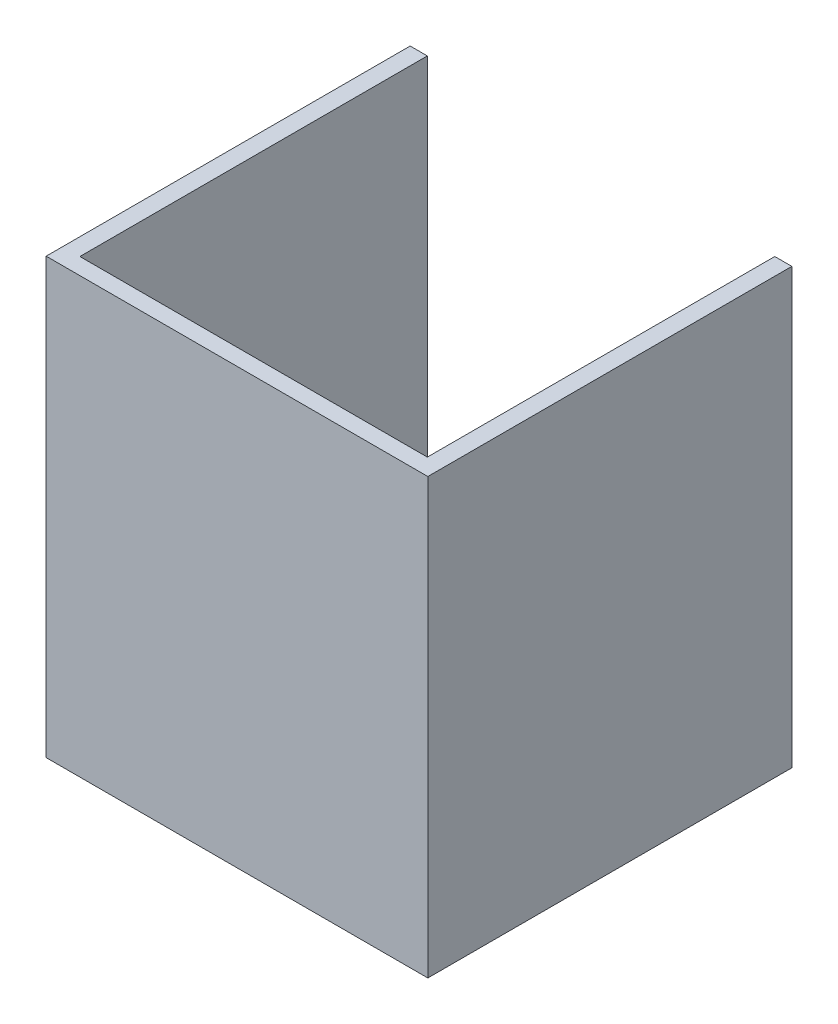
ISO-10303-21;
HEADER;
FILE_DESCRIPTION(('STEP AP214'),'2;1');
FILE_NAME('part.step','',(''),(''),'','','');
FILE_SCHEMA(('AUTOMOTIVE_DESIGN { 1 0 10303 214 1 1 1 1 }'));
ENDSEC;
DATA;
#1=APPLICATION_CONTEXT('core data for automotive mechanical design processes');
#2=APPLICATION_PROTOCOL_DEFINITION('international standard','automotive_design',2000,#1);
#3=PRODUCT_CONTEXT('',#1,'mechanical');
#4=PRODUCT('Part','Part','',(#3));
#5=PRODUCT_RELATED_PRODUCT_CATEGORY('part','',(#4));
#6=PRODUCT_DEFINITION_FORMATION('','',#4);
#7=PRODUCT_DEFINITION_CONTEXT('part definition',#1,'design');
#8=PRODUCT_DEFINITION('design','',#6,#7);
#9=PRODUCT_DEFINITION_SHAPE('','',#8);
#10=(LENGTH_UNIT() NAMED_UNIT(*) SI_UNIT(.MILLI.,.METRE.));
#11=(NAMED_UNIT(*) PLANE_ANGLE_UNIT() SI_UNIT($,.RADIAN.));
#12=(NAMED_UNIT(*) SI_UNIT($,.STERADIAN.) SOLID_ANGLE_UNIT());
#13=UNCERTAINTY_MEASURE_WITH_UNIT(LENGTH_MEASURE(1.E-05),#10,'distance_accuracy_value','');
#14=(GEOMETRIC_REPRESENTATION_CONTEXT(3) GLOBAL_UNCERTAINTY_ASSIGNED_CONTEXT((#13)) GLOBAL_UNIT_ASSIGNED_CONTEXT((#10,
#11,#12)) REPRESENTATION_CONTEXT('',''));
#15=CARTESIAN_POINT('',(0.,0.,0.));
#16=DIRECTION('',(0.,0.,1.));
#17=DIRECTION('',(1.,0.,0.));
#18=AXIS2_PLACEMENT_3D('',#15,#16,#17);
#19=CARTESIAN_POINT('',(0.,63.5,0.));
#20=DIRECTION('',(1.,0.,0.));
#21=DIRECTION('',(0.,0.,-1.));
#22=AXIS2_PLACEMENT_3D('',#19,#20,#21);
#23=PLANE('',#22);
#24=DIRECTION('',(0.,0.,1.));
#25=VECTOR('',#24,1.);
#26=CARTESIAN_POINT('',(0.,0.,0.));
#27=LINE('',#26,#25);
#28=CARTESIAN_POINT('',(0.,0.,0.));
#29=VERTEX_POINT('',#28);
#30=CARTESIAN_POINT('',(0.,0.,50.8));
#31=VERTEX_POINT('',#30);
#32=EDGE_CURVE('E130',#29,#31,#27,.T.);
#33=ORIENTED_EDGE('',*,*,#32,.T.);
#34=DIRECTION('',(0.,-1.,0.));
#35=VECTOR('',#34,1.);
#36=CARTESIAN_POINT('',(0.,63.5,50.8));
#37=LINE('',#36,#35);
#38=CARTESIAN_POINT('',(0.,63.5,50.8));
#39=VERTEX_POINT('',#38);
#40=EDGE_CURVE('E11',#39,#31,#37,.T.);
#41=ORIENTED_EDGE('',*,*,#40,.F.);
#42=DIRECTION('',(0.,0.,1.));
#43=VECTOR('',#42,1.);
#44=CARTESIAN_POINT('',(0.,63.5,0.));
#45=LINE('',#44,#43);
#46=CARTESIAN_POINT('',(0.,63.5,0.));
#47=VERTEX_POINT('',#46);
#48=EDGE_CURVE('E149',#47,#39,#45,.T.);
#49=ORIENTED_EDGE('',*,*,#48,.F.);
#50=DIRECTION('',(0.,-1.,0.));
#51=VECTOR('',#50,1.);
#52=CARTESIAN_POINT('',(0.,63.5,0.));
#53=LINE('',#52,#51);
#54=EDGE_CURVE('E49',#47,#29,#53,.T.);
#55=ORIENTED_EDGE('',*,*,#54,.T.);
#56=EDGE_LOOP('',(#33,#41,#49,#55));
#57=FACE_BOUND('',#56,.T.);
#58=ADVANCED_FACE('F33',(#57),#23,.F.);
#59=CARTESIAN_POINT('',(0.,63.5,50.8));
#60=DIRECTION('',(0.,0.,1.));
#61=DIRECTION('',(1.,0.,0.));
#62=AXIS2_PLACEMENT_3D('',#59,#60,#61);
#63=PLANE('',#62);
#64=DIRECTION('',(-1.,0.,0.));
#65=VECTOR('',#64,1.);
#66=CARTESIAN_POINT('',(0.,0.,50.8));
#67=LINE('',#66,#65);
#68=CARTESIAN_POINT('',(-50.8,0.,50.8));
#69=VERTEX_POINT('',#68);
#70=EDGE_CURVE('E132',#31,#69,#67,.T.);
#71=ORIENTED_EDGE('',*,*,#70,.T.);
#72=DIRECTION('',(0.,-1.,0.));
#73=VECTOR('',#72,1.);
#74=CARTESIAN_POINT('',(-50.8,63.5,50.8));
#75=LINE('',#74,#73);
#76=CARTESIAN_POINT('',(-50.8,63.5,50.8));
#77=VERTEX_POINT('',#76);
#78=EDGE_CURVE('E41',#77,#69,#75,.T.);
#79=ORIENTED_EDGE('',*,*,#78,.F.);
#80=DIRECTION('',(-1.,0.,0.));
#81=VECTOR('',#80,1.);
#82=CARTESIAN_POINT('',(0.,63.5,50.8));
#83=LINE('',#82,#81);
#84=EDGE_CURVE('E87',#39,#77,#83,.T.);
#85=ORIENTED_EDGE('',*,*,#84,.F.);
#86=ORIENTED_EDGE('',*,*,#40,.T.);
#87=EDGE_LOOP('',(#71,#79,#85,#86));
#88=FACE_BOUND('',#87,.T.);
#89=ADVANCED_FACE('F176',(#88),#63,.F.);
#90=CARTESIAN_POINT('',(-50.8,63.5,50.8));
#91=DIRECTION('',(-1.,0.,0.));
#92=DIRECTION('',(0.,0.,1.));
#93=AXIS2_PLACEMENT_3D('',#90,#91,#92);
#94=PLANE('',#93);
#95=DIRECTION('',(0.,0.,-1.));
#96=VECTOR('',#95,1.);
#97=CARTESIAN_POINT('',(-50.8,0.,50.8));
#98=LINE('',#97,#96);
#99=CARTESIAN_POINT('',(-50.8,0.,0.));
#100=VERTEX_POINT('',#99);
#101=EDGE_CURVE('E134',#69,#100,#98,.T.);
#102=ORIENTED_EDGE('',*,*,#101,.T.);
#103=DIRECTION('',(0.,-1.,0.));
#104=VECTOR('',#103,1.);
#105=CARTESIAN_POINT('',(-50.8,63.5,0.));
#106=LINE('',#105,#104);
#107=CARTESIAN_POINT('',(-50.8,63.5,0.));
#108=VERTEX_POINT('',#107);
#109=EDGE_CURVE('E155',#108,#100,#106,.T.);
#110=ORIENTED_EDGE('',*,*,#109,.F.);
#111=DIRECTION('',(0.,0.,-1.));
#112=VECTOR('',#111,1.);
#113=CARTESIAN_POINT('',(-50.8,63.5,50.8));
#114=LINE('',#113,#112);
#115=EDGE_CURVE('E162',#77,#108,#114,.T.);
#116=ORIENTED_EDGE('',*,*,#115,.F.);
#117=ORIENTED_EDGE('',*,*,#78,.T.);
#118=EDGE_LOOP('',(#102,#110,#116,#117));
#119=FACE_BOUND('',#118,.T.);
#120=ADVANCED_FACE('F160',(#119),#94,.F.);
#121=CARTESIAN_POINT('',(-53.3099818722462,63.5,0.));
#122=DIRECTION('',(0.,0.,-1.));
#123=DIRECTION('',(-1.,0.,0.));
#124=AXIS2_PLACEMENT_3D('',#121,#122,#123);
#125=PLANE('',#124);
#126=DIRECTION('',(1.,0.,0.));
#127=VECTOR('',#126,1.);
#128=CARTESIAN_POINT('',(-53.3099818722462,0.,0.));
#129=LINE('',#128,#127);
#130=CARTESIAN_POINT('',(-53.3099818722462,0.,0.));
#131=VERTEX_POINT('',#130);
#132=EDGE_CURVE('E137',#131,#100,#129,.T.);
#133=ORIENTED_EDGE('',*,*,#132,.F.);
#134=DIRECTION('',(0.,-1.,0.));
#135=VECTOR('',#134,1.);
#136=CARTESIAN_POINT('',(-53.3099818722462,63.5,0.));
#137=LINE('',#136,#135);
#138=CARTESIAN_POINT('',(-53.3099818722462,63.5,0.));
#139=VERTEX_POINT('',#138);
#140=EDGE_CURVE('E153',#139,#131,#137,.T.);
#141=ORIENTED_EDGE('',*,*,#140,.F.);
#142=DIRECTION('',(1.,0.,0.));
#143=VECTOR('',#142,1.);
#144=CARTESIAN_POINT('',(-53.3099818722462,63.5,0.));
#145=LINE('',#144,#143);
#146=EDGE_CURVE('E170',#139,#108,#145,.T.);
#147=ORIENTED_EDGE('',*,*,#146,.T.);
#148=ORIENTED_EDGE('',*,*,#109,.T.);
#149=EDGE_LOOP('',(#133,#141,#147,#148));
#150=FACE_BOUND('',#149,.T.);
#151=ADVANCED_FACE('F168',(#150),#125,.T.);
#152=CARTESIAN_POINT('',(-53.3099818722462,63.5,53.2219546333295));
#153=DIRECTION('',(-1.,0.,0.));
#154=DIRECTION('',(0.,0.,1.));
#155=AXIS2_PLACEMENT_3D('',#152,#153,#154);
#156=PLANE('',#155);
#157=DIRECTION('',(0.,0.,-1.));
#158=VECTOR('',#157,1.);
#159=CARTESIAN_POINT('',(-53.3099818722462,0.,53.2219546333295));
#160=LINE('',#159,#158);
#161=CARTESIAN_POINT('',(-53.3099818722462,0.,53.2219546333295));
#162=VERTEX_POINT('',#161);
#163=EDGE_CURVE('E140',#162,#131,#160,.T.);
#164=ORIENTED_EDGE('',*,*,#163,.F.);
#165=DIRECTION('',(0.,-1.,0.));
#166=VECTOR('',#165,1.);
#167=CARTESIAN_POINT('',(-53.3099818722462,63.5,53.2219546333295));
#168=LINE('',#167,#166);
#169=CARTESIAN_POINT('',(-53.3099818722462,63.5,53.2219546333295));
#170=VERTEX_POINT('',#169);
#171=EDGE_CURVE('E112',#170,#162,#168,.T.);
#172=ORIENTED_EDGE('',*,*,#171,.F.);
#173=DIRECTION('',(0.,0.,-1.));
#174=VECTOR('',#173,1.);
#175=CARTESIAN_POINT('',(-53.3099818722462,63.5,53.2219546333295));
#176=LINE('',#175,#174);
#177=EDGE_CURVE('E122',#170,#139,#176,.T.);
#178=ORIENTED_EDGE('',*,*,#177,.T.);
#179=ORIENTED_EDGE('',*,*,#140,.T.);
#180=EDGE_LOOP('',(#164,#172,#178,#179));
#181=FACE_BOUND('',#180,.T.);
#182=ADVANCED_FACE('F186',(#181),#156,.T.);
#183=CARTESIAN_POINT('',(2.49339392300385,63.5,53.2219546333295));
#184=DIRECTION('',(0.,0.,1.));
#185=DIRECTION('',(1.,0.,0.));
#186=AXIS2_PLACEMENT_3D('',#183,#184,#185);
#187=PLANE('',#186);
#188=DIRECTION('',(-1.,0.,0.));
#189=VECTOR('',#188,1.);
#190=CARTESIAN_POINT('',(2.49339392300385,0.,53.2219546333295));
#191=LINE('',#190,#189);
#192=CARTESIAN_POINT('',(2.49339392300385,0.,53.2219546333295));
#193=VERTEX_POINT('',#192);
#194=EDGE_CURVE('E108',#193,#162,#191,.T.);
#195=ORIENTED_EDGE('',*,*,#194,.F.);
#196=DIRECTION('',(0.,-1.,0.));
#197=VECTOR('',#196,1.);
#198=CARTESIAN_POINT('',(2.49339392300385,63.5,53.2219546333295));
#199=LINE('',#198,#197);
#200=CARTESIAN_POINT('',(2.49339392300385,63.5,53.2219546333295));
#201=VERTEX_POINT('',#200);
#202=EDGE_CURVE('E103',#201,#193,#199,.T.);
#203=ORIENTED_EDGE('',*,*,#202,.F.);
#204=DIRECTION('',(-1.,0.,0.));
#205=VECTOR('',#204,1.);
#206=CARTESIAN_POINT('',(2.49339392300385,63.5,53.2219546333295));
#207=LINE('',#206,#205);
#208=EDGE_CURVE('E106',#201,#170,#207,.T.);
#209=ORIENTED_EDGE('',*,*,#208,.T.);
#210=ORIENTED_EDGE('',*,*,#171,.T.);
#211=EDGE_LOOP('',(#195,#203,#209,#210));
#212=FACE_BOUND('',#211,.T.);
#213=ADVANCED_FACE('F105',(#212),#187,.T.);
#214=CARTESIAN_POINT('',(2.49339392300385,63.5,0.));
#215=DIRECTION('',(1.,0.,0.));
#216=DIRECTION('',(0.,0.,-1.));
#217=AXIS2_PLACEMENT_3D('',#214,#215,#216);
#218=PLANE('',#217);
#219=DIRECTION('',(0.,0.,1.));
#220=VECTOR('',#219,1.);
#221=CARTESIAN_POINT('',(2.49339392300385,0.,0.));
#222=LINE('',#221,#220);
#223=CARTESIAN_POINT('',(2.49339392300385,0.,0.));
#224=VERTEX_POINT('',#223);
#225=EDGE_CURVE('E144',#224,#193,#222,.T.);
#226=ORIENTED_EDGE('',*,*,#225,.F.);
#227=DIRECTION('',(0.,-1.,0.));
#228=VECTOR('',#227,1.);
#229=CARTESIAN_POINT('',(2.49339392300385,63.5,0.));
#230=LINE('',#229,#228);
#231=CARTESIAN_POINT('',(2.49339392300385,63.5,0.));
#232=VERTEX_POINT('',#231);
#233=EDGE_CURVE('E75',#232,#224,#230,.T.);
#234=ORIENTED_EDGE('',*,*,#233,.F.);
#235=DIRECTION('',(0.,0.,1.));
#236=VECTOR('',#235,1.);
#237=CARTESIAN_POINT('',(2.49339392300385,63.5,0.));
#238=LINE('',#237,#236);
#239=EDGE_CURVE('E119',#232,#201,#238,.T.);
#240=ORIENTED_EDGE('',*,*,#239,.T.);
#241=ORIENTED_EDGE('',*,*,#202,.T.);
#242=EDGE_LOOP('',(#226,#234,#240,#241));
#243=FACE_BOUND('',#242,.T.);
#244=ADVANCED_FACE('F124',(#243),#218,.T.);
#245=CARTESIAN_POINT('',(0.,63.5,0.));
#246=DIRECTION('',(0.,0.,-1.));
#247=DIRECTION('',(-1.,0.,0.));
#248=AXIS2_PLACEMENT_3D('',#245,#246,#247);
#249=PLANE('',#248);
#250=DIRECTION('',(1.,0.,0.));
#251=VECTOR('',#250,1.);
#252=CARTESIAN_POINT('',(0.,0.,0.));
#253=LINE('',#252,#251);
#254=EDGE_CURVE('E146',#29,#224,#253,.T.);
#255=ORIENTED_EDGE('',*,*,#254,.F.);
#256=ORIENTED_EDGE('',*,*,#54,.F.);
#257=DIRECTION('',(1.,0.,0.));
#258=VECTOR('',#257,1.);
#259=CARTESIAN_POINT('',(0.,63.5,0.));
#260=LINE('',#259,#258);
#261=EDGE_CURVE('E125',#47,#232,#260,.T.);
#262=ORIENTED_EDGE('',*,*,#261,.T.);
#263=ORIENTED_EDGE('',*,*,#233,.T.);
#264=EDGE_LOOP('',(#255,#256,#262,#263));
#265=FACE_BOUND('',#264,.T.);
#266=ADVANCED_FACE('F194',(#265),#249,.T.);
#267=CARTESIAN_POINT('',(0.,63.5,0.));
#268=DIRECTION('',(0.,-1.,0.));
#269=DIRECTION('',(0.,0.,-1.));
#270=AXIS2_PLACEMENT_3D('',#267,#268,#269);
#271=PLANE('',#270);
#272=ORIENTED_EDGE('',*,*,#48,.T.);
#273=ORIENTED_EDGE('',*,*,#84,.T.);
#274=ORIENTED_EDGE('',*,*,#115,.T.);
#275=ORIENTED_EDGE('',*,*,#146,.F.);
#276=ORIENTED_EDGE('',*,*,#177,.F.);
#277=ORIENTED_EDGE('',*,*,#208,.F.);
#278=ORIENTED_EDGE('',*,*,#239,.F.);
#279=ORIENTED_EDGE('',*,*,#261,.F.);
#280=EDGE_LOOP('',(#272,#273,#274,#275,#276,#277,#278,#279));
#281=FACE_BOUND('',#280,.T.);
#282=ADVANCED_FACE('F117',(#281),#271,.F.);
#283=CARTESIAN_POINT('',(0.,0.,0.));
#284=DIRECTION('',(0.,-1.,0.));
#285=DIRECTION('',(0.,0.,-1.));
#286=AXIS2_PLACEMENT_3D('',#283,#284,#285);
#287=PLANE('',#286);
#288=ORIENTED_EDGE('',*,*,#32,.F.);
#289=ORIENTED_EDGE('',*,*,#254,.T.);
#290=ORIENTED_EDGE('',*,*,#225,.T.);
#291=ORIENTED_EDGE('',*,*,#194,.T.);
#292=ORIENTED_EDGE('',*,*,#163,.T.);
#293=ORIENTED_EDGE('',*,*,#132,.T.);
#294=ORIENTED_EDGE('',*,*,#101,.F.);
#295=ORIENTED_EDGE('',*,*,#70,.F.);
#296=EDGE_LOOP('',(#288,#289,#290,#291,#292,#293,#294,#295));
#297=FACE_BOUND('',#296,.T.);
#298=ADVANCED_FACE('F164',(#297),#287,.T.);
#299=CLOSED_SHELL('',(#58,#89,#120,#151,#182,#213,#244,#266,#282,#298));
#300=MANIFOLD_SOLID_BREP('B2',#299);
#301=ADVANCED_BREP_SHAPE_REPRESENTATION('',(#18,#300),#14);
#302=SHAPE_DEFINITION_REPRESENTATION(#9,#301);
ENDSEC;
END-ISO-10303-21;
